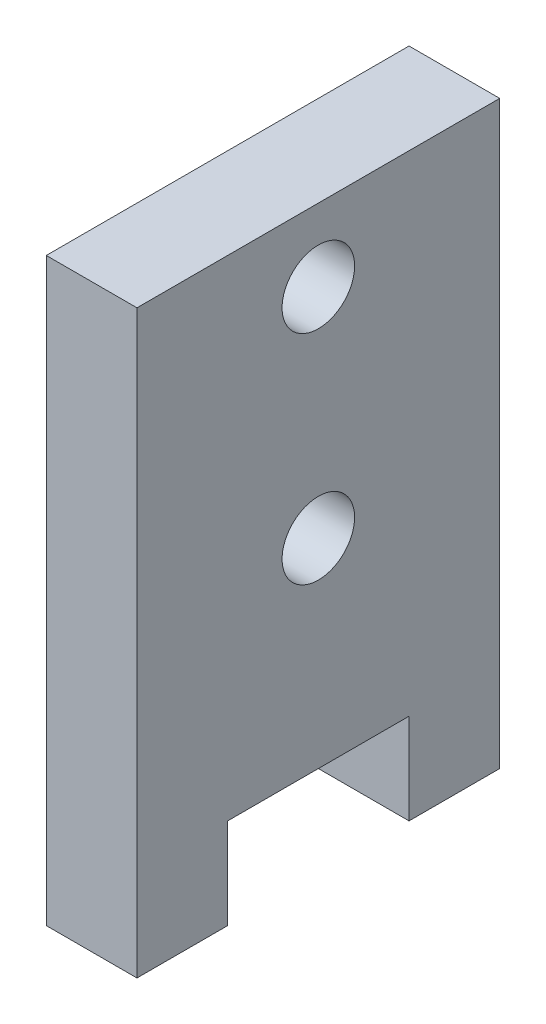
ISO-10303-21;
HEADER;
FILE_DESCRIPTION(('STEP AP214'),'2;1');
FILE_NAME('part.step','',(''),(''),'','','');
FILE_SCHEMA(('AUTOMOTIVE_DESIGN { 1 0 10303 214 1 1 1 1 }'));
ENDSEC;
DATA;
#1=APPLICATION_CONTEXT('core data for automotive mechanical design processes');
#2=APPLICATION_PROTOCOL_DEFINITION('international standard','automotive_design',2000,#1);
#3=PRODUCT_CONTEXT('',#1,'mechanical');
#4=PRODUCT('Part','Part','',(#3));
#5=PRODUCT_RELATED_PRODUCT_CATEGORY('part','',(#4));
#6=PRODUCT_DEFINITION_FORMATION('','',#4);
#7=PRODUCT_DEFINITION_CONTEXT('part definition',#1,'design');
#8=PRODUCT_DEFINITION('design','',#6,#7);
#9=PRODUCT_DEFINITION_SHAPE('','',#8);
#10=(LENGTH_UNIT() NAMED_UNIT(*) SI_UNIT(.MILLI.,.METRE.));
#11=(NAMED_UNIT(*) PLANE_ANGLE_UNIT() SI_UNIT($,.RADIAN.));
#12=(NAMED_UNIT(*) SI_UNIT($,.STERADIAN.) SOLID_ANGLE_UNIT());
#13=UNCERTAINTY_MEASURE_WITH_UNIT(LENGTH_MEASURE(1.E-05),#10,'distance_accuracy_value','');
#14=(GEOMETRIC_REPRESENTATION_CONTEXT(3) GLOBAL_UNCERTAINTY_ASSIGNED_CONTEXT((#13)) GLOBAL_UNIT_ASSIGNED_CONTEXT((#10,
#11,#12)) REPRESENTATION_CONTEXT('',''));
#15=CARTESIAN_POINT('',(0.,0.,0.));
#16=DIRECTION('',(0.,0.,1.));
#17=DIRECTION('',(1.,0.,0.));
#18=AXIS2_PLACEMENT_3D('',#15,#16,#17);
#19=CARTESIAN_POINT('',(3.175,-10.16,6.35));
#20=DIRECTION('',(0.,1.,0.));
#21=DIRECTION('',(0.,0.,1.));
#22=AXIS2_PLACEMENT_3D('',#19,#20,#21);
#23=PLANE('',#22);
#24=DIRECTION('',(0.,0.,-1.));
#25=VECTOR('',#24,1.);
#26=CARTESIAN_POINT('',(0.,-10.16,6.35));
#27=LINE('',#26,#25);
#28=CARTESIAN_POINT('',(0.,-10.16,6.35));
#29=VERTEX_POINT('',#28);
#30=CARTESIAN_POINT('',(0.,-10.16,3.175));
#31=VERTEX_POINT('',#30);
#32=EDGE_CURVE('E123',#29,#31,#27,.T.);
#33=ORIENTED_EDGE('',*,*,#32,.T.);
#34=DIRECTION('',(1.,0.,0.));
#35=VECTOR('',#34,1.);
#36=CARTESIAN_POINT('',(0.,-10.16,3.175));
#37=LINE('',#36,#35);
#38=CARTESIAN_POINT('',(3.175,-10.16,3.175));
#39=VERTEX_POINT('',#38);
#40=EDGE_CURVE('E107',#31,#39,#37,.T.);
#41=ORIENTED_EDGE('',*,*,#40,.T.);
#42=DIRECTION('',(0.,0.,-1.));
#43=VECTOR('',#42,1.);
#44=CARTESIAN_POINT('',(3.175,-10.16,6.35));
#45=LINE('',#44,#43);
#46=CARTESIAN_POINT('',(3.175,-10.16,6.35));
#47=VERTEX_POINT('',#46);
#48=EDGE_CURVE('E140',#47,#39,#45,.T.);
#49=ORIENTED_EDGE('',*,*,#48,.F.);
#50=DIRECTION('',(-1.,0.,0.));
#51=VECTOR('',#50,1.);
#52=CARTESIAN_POINT('',(3.175,-10.16,6.35));
#53=LINE('',#52,#51);
#54=EDGE_CURVE('E130',#47,#29,#53,.T.);
#55=ORIENTED_EDGE('',*,*,#54,.T.);
#56=EDGE_LOOP('',(#33,#41,#49,#55));
#57=FACE_BOUND('',#56,.T.);
#58=ADVANCED_FACE('F32',(#57),#23,.F.);
#59=CARTESIAN_POINT('',(3.175,-10.16,-6.35));
#60=DIRECTION('',(0.,0.,1.));
#61=DIRECTION('',(1.,0.,0.));
#62=AXIS2_PLACEMENT_3D('',#59,#60,#61);
#63=PLANE('',#62);
#64=DIRECTION('',(0.,1.,0.));
#65=VECTOR('',#64,1.);
#66=CARTESIAN_POINT('',(0.,-10.16,-6.35));
#67=LINE('',#66,#65);
#68=CARTESIAN_POINT('',(0.,-10.16,-6.35));
#69=VERTEX_POINT('',#68);
#70=CARTESIAN_POINT('',(0.,10.16,-6.35));
#71=VERTEX_POINT('',#70);
#72=EDGE_CURVE('E148',#69,#71,#67,.T.);
#73=ORIENTED_EDGE('',*,*,#72,.T.);
#74=DIRECTION('',(-1.,0.,0.));
#75=VECTOR('',#74,1.);
#76=CARTESIAN_POINT('',(3.175,10.16,-6.35));
#77=LINE('',#76,#75);
#78=CARTESIAN_POINT('',(3.175,10.16,-6.35));
#79=VERTEX_POINT('',#78);
#80=EDGE_CURVE('E11',#79,#71,#77,.T.);
#81=ORIENTED_EDGE('',*,*,#80,.F.);
#82=DIRECTION('',(0.,1.,0.));
#83=VECTOR('',#82,1.);
#84=CARTESIAN_POINT('',(3.175,-10.16,-6.35));
#85=LINE('',#84,#83);
#86=CARTESIAN_POINT('',(3.175,-10.16,-6.35));
#87=VERTEX_POINT('',#86);
#88=EDGE_CURVE('E131',#87,#79,#85,.T.);
#89=ORIENTED_EDGE('',*,*,#88,.F.);
#90=DIRECTION('',(-1.,0.,0.));
#91=VECTOR('',#90,1.);
#92=CARTESIAN_POINT('',(3.175,-10.16,-6.35));
#93=LINE('',#92,#91);
#94=EDGE_CURVE('E138',#87,#69,#93,.T.);
#95=ORIENTED_EDGE('',*,*,#94,.T.);
#96=EDGE_LOOP('',(#73,#81,#89,#95));
#97=FACE_BOUND('',#96,.T.);
#98=ADVANCED_FACE('F34',(#97),#63,.F.);
#99=CARTESIAN_POINT('',(3.175,10.16,6.35));
#100=DIRECTION('',(0.,-1.,0.));
#101=DIRECTION('',(0.,0.,-1.));
#102=AXIS2_PLACEMENT_3D('',#99,#100,#101);
#103=PLANE('',#102);
#104=DIRECTION('',(0.,0.,1.));
#105=VECTOR('',#104,1.);
#106=CARTESIAN_POINT('',(0.,10.16,6.35));
#107=LINE('',#106,#105);
#108=CARTESIAN_POINT('',(0.,10.16,6.35));
#109=VERTEX_POINT('',#108);
#110=EDGE_CURVE('E147',#71,#109,#107,.T.);
#111=ORIENTED_EDGE('',*,*,#110,.T.);
#112=DIRECTION('',(-1.,0.,0.));
#113=VECTOR('',#112,1.);
#114=CARTESIAN_POINT('',(3.175,10.16,6.35));
#115=LINE('',#114,#113);
#116=CARTESIAN_POINT('',(3.175,10.16,6.35));
#117=VERTEX_POINT('',#116);
#118=EDGE_CURVE('E40',#117,#109,#115,.T.);
#119=ORIENTED_EDGE('',*,*,#118,.F.);
#120=DIRECTION('',(0.,0.,1.));
#121=VECTOR('',#120,1.);
#122=CARTESIAN_POINT('',(3.175,10.16,6.35));
#123=LINE('',#122,#121);
#124=EDGE_CURVE('E85',#79,#117,#123,.T.);
#125=ORIENTED_EDGE('',*,*,#124,.F.);
#126=ORIENTED_EDGE('',*,*,#80,.T.);
#127=EDGE_LOOP('',(#111,#119,#125,#126));
#128=FACE_BOUND('',#127,.T.);
#129=ADVANCED_FACE('F200',(#128),#103,.F.);
#130=CARTESIAN_POINT('',(3.175,-10.16,6.35));
#131=DIRECTION('',(0.,0.,-1.));
#132=DIRECTION('',(-1.,0.,0.));
#133=AXIS2_PLACEMENT_3D('',#130,#131,#132);
#134=PLANE('',#133);
#135=DIRECTION('',(0.,-1.,0.));
#136=VECTOR('',#135,1.);
#137=CARTESIAN_POINT('',(0.,-10.16,6.35));
#138=LINE('',#137,#136);
#139=EDGE_CURVE('E134',#109,#29,#138,.T.);
#140=ORIENTED_EDGE('',*,*,#139,.T.);
#141=ORIENTED_EDGE('',*,*,#54,.F.);
#142=DIRECTION('',(0.,-1.,0.));
#143=VECTOR('',#142,1.);
#144=CARTESIAN_POINT('',(3.175,-10.16,6.35));
#145=LINE('',#144,#143);
#146=EDGE_CURVE('E145',#117,#47,#145,.T.);
#147=ORIENTED_EDGE('',*,*,#146,.F.);
#148=ORIENTED_EDGE('',*,*,#118,.T.);
#149=EDGE_LOOP('',(#140,#141,#147,#148));
#150=FACE_BOUND('',#149,.T.);
#151=ADVANCED_FACE('F144',(#150),#134,.F.);
#152=CARTESIAN_POINT('',(3.175,-10.16,-3.175));
#153=VERTEX_POINT('',#152);
#154=EDGE_CURVE('E56',#153,#87,#45,.T.);
#155=ORIENTED_EDGE('',*,*,#154,.F.);
#156=DIRECTION('',(1.,0.,0.));
#157=VECTOR('',#156,1.);
#158=CARTESIAN_POINT('',(0.,-10.16,-3.175));
#159=LINE('',#158,#157);
#160=CARTESIAN_POINT('',(0.,-10.16,-3.175));
#161=VERTEX_POINT('',#160);
#162=EDGE_CURVE('E117',#161,#153,#159,.T.);
#163=ORIENTED_EDGE('',*,*,#162,.F.);
#164=EDGE_CURVE('E78',#161,#69,#27,.T.);
#165=ORIENTED_EDGE('',*,*,#164,.T.);
#166=ORIENTED_EDGE('',*,*,#94,.F.);
#167=EDGE_LOOP('',(#155,#163,#165,#166));
#168=FACE_BOUND('',#167,.T.);
#169=ADVANCED_FACE('F193',(#168),#23,.F.);
#170=CARTESIAN_POINT('',(3.175,0.,0.));
#171=DIRECTION('',(-1.,0.,0.));
#172=DIRECTION('',(0.,0.,1.));
#173=AXIS2_PLACEMENT_3D('',#170,#171,#172);
#174=PLANE('',#173);
#175=CARTESIAN_POINT('',(3.175,0.,0.));
#176=DIRECTION('',(1.,0.,0.));
#177=DIRECTION('',(0.,0.,-1.));
#178=AXIS2_PLACEMENT_3D('',#175,#176,#177);
#179=CIRCLE('',#178,1.27);
#180=CARTESIAN_POINT('',(3.175,0.,-1.27));
#181=VERTEX_POINT('',#180);
#182=EDGE_CURVE('E175',#181,#181,#179,.T.);
#183=ORIENTED_EDGE('',*,*,#182,.F.);
#184=EDGE_LOOP('',(#183));
#185=FACE_BOUND('',#184,.T.);
#186=CARTESIAN_POINT('',(3.175,7.62,0.));
#187=DIRECTION('',(1.,0.,0.));
#188=DIRECTION('',(0.,0.,-1.));
#189=AXIS2_PLACEMENT_3D('',#186,#187,#188);
#190=CIRCLE('',#189,1.27);
#191=CARTESIAN_POINT('',(3.175,7.62,-1.26999999999997));
#192=VERTEX_POINT('',#191);
#193=EDGE_CURVE('E169',#192,#192,#190,.T.);
#194=ORIENTED_EDGE('',*,*,#193,.F.);
#195=EDGE_LOOP('',(#194));
#196=FACE_BOUND('',#195,.T.);
#197=ORIENTED_EDGE('',*,*,#48,.T.);
#198=DIRECTION('',(0.,-1.,0.));
#199=VECTOR('',#198,1.);
#200=CARTESIAN_POINT('',(3.175,-10.16,3.175));
#201=LINE('',#200,#199);
#202=CARTESIAN_POINT('',(3.175,-6.985,3.175));
#203=VERTEX_POINT('',#202);
#204=EDGE_CURVE('E112',#203,#39,#201,.T.);
#205=ORIENTED_EDGE('',*,*,#204,.F.);
#206=DIRECTION('',(0.,0.,1.));
#207=VECTOR('',#206,1.);
#208=CARTESIAN_POINT('',(3.175,-6.985,3.175));
#209=LINE('',#208,#207);
#210=CARTESIAN_POINT('',(3.175,-6.985,-3.175));
#211=VERTEX_POINT('',#210);
#212=EDGE_CURVE('E126',#211,#203,#209,.T.);
#213=ORIENTED_EDGE('',*,*,#212,.F.);
#214=DIRECTION('',(0.,1.,0.));
#215=VECTOR('',#214,1.);
#216=CARTESIAN_POINT('',(3.175,-10.16,-3.175));
#217=LINE('',#216,#215);
#218=EDGE_CURVE('E162',#153,#211,#217,.T.);
#219=ORIENTED_EDGE('',*,*,#218,.F.);
#220=ORIENTED_EDGE('',*,*,#154,.T.);
#221=ORIENTED_EDGE('',*,*,#88,.T.);
#222=ORIENTED_EDGE('',*,*,#124,.T.);
#223=ORIENTED_EDGE('',*,*,#146,.T.);
#224=EDGE_LOOP('',(#197,#205,#213,#219,#220,#221,#222,#223));
#225=FACE_BOUND('',#224,.T.);
#226=ADVANCED_FACE('F190',(#185,#196,#225),#174,.F.);
#227=CARTESIAN_POINT('',(0.,0.,0.));
#228=DIRECTION('',(-1.,0.,0.));
#229=DIRECTION('',(0.,0.,1.));
#230=AXIS2_PLACEMENT_3D('',#227,#228,#229);
#231=PLANE('',#230);
#232=CARTESIAN_POINT('',(0.,0.,0.));
#233=DIRECTION('',(1.,0.,0.));
#234=DIRECTION('',(0.,0.,-1.));
#235=AXIS2_PLACEMENT_3D('',#232,#233,#234);
#236=CIRCLE('',#235,1.27);
#237=CARTESIAN_POINT('',(0.,0.,-1.27));
#238=VERTEX_POINT('',#237);
#239=EDGE_CURVE('E166',#238,#238,#236,.T.);
#240=ORIENTED_EDGE('',*,*,#239,.T.);
#241=EDGE_LOOP('',(#240));
#242=FACE_BOUND('',#241,.T.);
#243=CARTESIAN_POINT('',(0.,7.62,0.));
#244=DIRECTION('',(1.,0.,0.));
#245=DIRECTION('',(0.,0.,-1.));
#246=AXIS2_PLACEMENT_3D('',#243,#244,#245);
#247=CIRCLE('',#246,1.27);
#248=CARTESIAN_POINT('',(0.,7.62,-1.26999999999997));
#249=VERTEX_POINT('',#248);
#250=EDGE_CURVE('E172',#249,#249,#247,.T.);
#251=ORIENTED_EDGE('',*,*,#250,.T.);
#252=EDGE_LOOP('',(#251));
#253=FACE_BOUND('',#252,.T.);
#254=DIRECTION('',(0.,-1.,0.));
#255=VECTOR('',#254,1.);
#256=CARTESIAN_POINT('',(0.,-10.16,3.175));
#257=LINE('',#256,#255);
#258=CARTESIAN_POINT('',(0.,-6.985,3.175));
#259=VERTEX_POINT('',#258);
#260=EDGE_CURVE('E110',#259,#31,#257,.T.);
#261=ORIENTED_EDGE('',*,*,#260,.T.);
#262=ORIENTED_EDGE('',*,*,#32,.F.);
#263=ORIENTED_EDGE('',*,*,#139,.F.);
#264=ORIENTED_EDGE('',*,*,#110,.F.);
#265=ORIENTED_EDGE('',*,*,#72,.F.);
#266=ORIENTED_EDGE('',*,*,#164,.F.);
#267=DIRECTION('',(0.,1.,0.));
#268=VECTOR('',#267,1.);
#269=CARTESIAN_POINT('',(0.,-10.16,-3.175));
#270=LINE('',#269,#268);
#271=CARTESIAN_POINT('',(0.,-6.985,-3.175));
#272=VERTEX_POINT('',#271);
#273=EDGE_CURVE('E125',#161,#272,#270,.T.);
#274=ORIENTED_EDGE('',*,*,#273,.T.);
#275=DIRECTION('',(0.,0.,1.));
#276=VECTOR('',#275,1.);
#277=CARTESIAN_POINT('',(0.,-6.985,3.175));
#278=LINE('',#277,#276);
#279=EDGE_CURVE('E47',#272,#259,#278,.T.);
#280=ORIENTED_EDGE('',*,*,#279,.T.);
#281=EDGE_LOOP('',(#261,#262,#263,#264,#265,#266,#274,#280));
#282=FACE_BOUND('',#281,.T.);
#283=ADVANCED_FACE('F121',(#242,#253,#282),#231,.T.);
#284=CARTESIAN_POINT('',(0.,-10.16,3.175));
#285=DIRECTION('',(0.,0.,1.));
#286=DIRECTION('',(1.,0.,0.));
#287=AXIS2_PLACEMENT_3D('',#284,#285,#286);
#288=PLANE('',#287);
#289=ORIENTED_EDGE('',*,*,#204,.T.);
#290=ORIENTED_EDGE('',*,*,#40,.F.);
#291=ORIENTED_EDGE('',*,*,#260,.F.);
#292=DIRECTION('',(1.,0.,0.));
#293=VECTOR('',#292,1.);
#294=CARTESIAN_POINT('',(0.,-6.985,3.175));
#295=LINE('',#294,#293);
#296=EDGE_CURVE('E150',#259,#203,#295,.T.);
#297=ORIENTED_EDGE('',*,*,#296,.T.);
#298=EDGE_LOOP('',(#289,#290,#291,#297));
#299=FACE_BOUND('',#298,.T.);
#300=ADVANCED_FACE('F109',(#299),#288,.F.);
#301=CARTESIAN_POINT('',(0.,-6.985,3.175));
#302=DIRECTION('',(0.,1.,0.));
#303=DIRECTION('',(0.,0.,1.));
#304=AXIS2_PLACEMENT_3D('',#301,#302,#303);
#305=PLANE('',#304);
#306=ORIENTED_EDGE('',*,*,#212,.T.);
#307=ORIENTED_EDGE('',*,*,#296,.F.);
#308=ORIENTED_EDGE('',*,*,#279,.F.);
#309=DIRECTION('',(1.,0.,0.));
#310=VECTOR('',#309,1.);
#311=CARTESIAN_POINT('',(0.,-6.985,-3.175));
#312=LINE('',#311,#310);
#313=EDGE_CURVE('E157',#272,#211,#312,.T.);
#314=ORIENTED_EDGE('',*,*,#313,.T.);
#315=EDGE_LOOP('',(#306,#307,#308,#314));
#316=FACE_BOUND('',#315,.T.);
#317=ADVANCED_FACE('F217',(#316),#305,.F.);
#318=CARTESIAN_POINT('',(0.,-10.16,-3.175));
#319=DIRECTION('',(0.,0.,-1.));
#320=DIRECTION('',(-1.,0.,0.));
#321=AXIS2_PLACEMENT_3D('',#318,#319,#320);
#322=PLANE('',#321);
#323=ORIENTED_EDGE('',*,*,#218,.T.);
#324=ORIENTED_EDGE('',*,*,#313,.F.);
#325=ORIENTED_EDGE('',*,*,#273,.F.);
#326=ORIENTED_EDGE('',*,*,#162,.T.);
#327=EDGE_LOOP('',(#323,#324,#325,#326));
#328=FACE_BOUND('',#327,.T.);
#329=ADVANCED_FACE('F216',(#328),#322,.F.);
#330=CARTESIAN_POINT('',(0.,7.62,0.));
#331=DIRECTION('',(1.,0.,0.));
#332=DIRECTION('',(0.,0.,-1.));
#333=AXIS2_PLACEMENT_3D('',#330,#331,#332);
#334=CYLINDRICAL_SURFACE('',#333,1.27);
#335=ORIENTED_EDGE('',*,*,#250,.F.);
#336=EDGE_LOOP('',(#335));
#337=FACE_BOUND('',#336,.T.);
#338=ORIENTED_EDGE('',*,*,#193,.T.);
#339=EDGE_LOOP('',(#338));
#340=FACE_BOUND('',#339,.T.);
#341=ADVANCED_FACE('F186',(#337,#340),#334,.F.);
#342=CARTESIAN_POINT('',(0.,0.,0.));
#343=DIRECTION('',(1.,0.,0.));
#344=DIRECTION('',(0.,0.,-1.));
#345=AXIS2_PLACEMENT_3D('',#342,#343,#344);
#346=CYLINDRICAL_SURFACE('',#345,1.27);
#347=ORIENTED_EDGE('',*,*,#239,.F.);
#348=EDGE_LOOP('',(#347));
#349=FACE_BOUND('',#348,.T.);
#350=ORIENTED_EDGE('',*,*,#182,.T.);
#351=EDGE_LOOP('',(#350));
#352=FACE_BOUND('',#351,.T.);
#353=ADVANCED_FACE('F183',(#349,#352),#346,.F.);
#354=CLOSED_SHELL('',(#58,#98,#129,#151,#169,#226,#283,#300,#317,#329,#341,#353));
#355=MANIFOLD_SOLID_BREP('B2',#354);
#356=ADVANCED_BREP_SHAPE_REPRESENTATION('',(#18,#355),#14);
#357=SHAPE_DEFINITION_REPRESENTATION(#9,#356);
ENDSEC;
END-ISO-10303-21;
